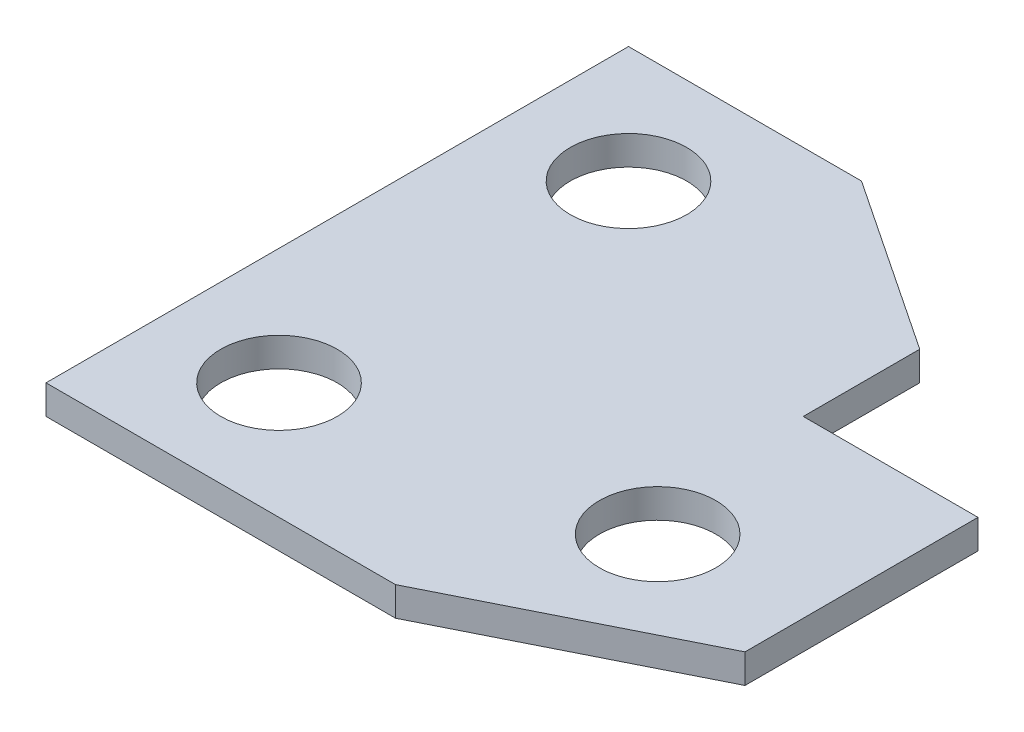
ISO-10303-21;
HEADER;
FILE_DESCRIPTION(('STEP AP214'),'2;1');
FILE_NAME('part.step','',(''),(''),'','','');
FILE_SCHEMA(('AUTOMOTIVE_DESIGN { 1 0 10303 214 1 1 1 1 }'));
ENDSEC;
DATA;
#1=APPLICATION_CONTEXT('core data for automotive mechanical design processes');
#2=APPLICATION_PROTOCOL_DEFINITION('international standard','automotive_design',2000,#1);
#3=PRODUCT_CONTEXT('',#1,'mechanical');
#4=PRODUCT('Part','Part','',(#3));
#5=PRODUCT_RELATED_PRODUCT_CATEGORY('part','',(#4));
#6=PRODUCT_DEFINITION_FORMATION('','',#4);
#7=PRODUCT_DEFINITION_CONTEXT('part definition',#1,'design');
#8=PRODUCT_DEFINITION('design','',#6,#7);
#9=PRODUCT_DEFINITION_SHAPE('','',#8);
#10=(LENGTH_UNIT() NAMED_UNIT(*) SI_UNIT(.MILLI.,.METRE.));
#11=(NAMED_UNIT(*) PLANE_ANGLE_UNIT() SI_UNIT($,.RADIAN.));
#12=(NAMED_UNIT(*) SI_UNIT($,.STERADIAN.) SOLID_ANGLE_UNIT());
#13=UNCERTAINTY_MEASURE_WITH_UNIT(LENGTH_MEASURE(1.E-05),#10,'distance_accuracy_value','');
#14=(GEOMETRIC_REPRESENTATION_CONTEXT(3) GLOBAL_UNCERTAINTY_ASSIGNED_CONTEXT((#13)) GLOBAL_UNIT_ASSIGNED_CONTEXT((#10,
#11,#12)) REPRESENTATION_CONTEXT('',''));
#15=CARTESIAN_POINT('',(0.,0.,0.));
#16=DIRECTION('',(0.,0.,1.));
#17=DIRECTION('',(1.,0.,0.));
#18=AXIS2_PLACEMENT_3D('',#15,#16,#17);
#19=CARTESIAN_POINT('',(0.,5.,0.));
#20=DIRECTION('',(0.,-1.,0.));
#21=DIRECTION('',(0.,0.,-1.));
#22=AXIS2_PLACEMENT_3D('',#19,#20,#21);
#23=PLANE('',#22);
#24=DIRECTION('',(0.,0.,1.));
#25=VECTOR('',#24,1.);
#26=CARTESIAN_POINT('',(0.,5.,0.));
#27=LINE('',#26,#25);
#28=CARTESIAN_POINT('',(0.,5.,-100.));
#29=VERTEX_POINT('',#28);
#30=CARTESIAN_POINT('',(0.,5.,0.));
#31=VERTEX_POINT('',#30);
#32=EDGE_CURVE('E168',#29,#31,#27,.T.);
#33=ORIENTED_EDGE('',*,*,#32,.T.);
#34=DIRECTION('',(1.,0.,0.));
#35=VECTOR('',#34,1.);
#36=CARTESIAN_POINT('',(0.,5.,0.));
#37=LINE('',#36,#35);
#38=CARTESIAN_POINT('',(60.,5.,0.));
#39=VERTEX_POINT('',#38);
#40=EDGE_CURVE('E104',#31,#39,#37,.T.);
#41=ORIENTED_EDGE('',*,*,#40,.T.);
#42=DIRECTION('',(0.894427190999916,0.,-0.447213595499958));
#43=VECTOR('',#42,1.);
#44=CARTESIAN_POINT('',(100.,5.,-20.));
#45=LINE('',#44,#43);
#46=CARTESIAN_POINT('',(100.,5.,-20.));
#47=VERTEX_POINT('',#46);
#48=EDGE_CURVE('E189',#39,#47,#45,.T.);
#49=ORIENTED_EDGE('',*,*,#48,.T.);
#50=DIRECTION('',(0.,0.,-1.));
#51=VECTOR('',#50,1.);
#52=CARTESIAN_POINT('',(100.,5.,-20.));
#53=LINE('',#52,#51);
#54=CARTESIAN_POINT('',(100.,5.,-60.));
#55=VERTEX_POINT('',#54);
#56=EDGE_CURVE('E203',#47,#55,#53,.T.);
#57=ORIENTED_EDGE('',*,*,#56,.T.);
#58=DIRECTION('',(-1.,0.,0.));
#59=VECTOR('',#58,1.);
#60=CARTESIAN_POINT('',(70.,5.,-60.));
#61=LINE('',#60,#59);
#62=CARTESIAN_POINT('',(70.,5.,-60.));
#63=VERTEX_POINT('',#62);
#64=EDGE_CURVE('E123',#55,#63,#61,.T.);
#65=ORIENTED_EDGE('',*,*,#64,.T.);
#66=DIRECTION('',(0.,0.,-1.));
#67=VECTOR('',#66,1.);
#68=CARTESIAN_POINT('',(70.,5.,-60.));
#69=LINE('',#68,#67);
#70=CARTESIAN_POINT('',(70.,5.,-80.));
#71=VERTEX_POINT('',#70);
#72=EDGE_CURVE('E117',#63,#71,#69,.T.);
#73=ORIENTED_EDGE('',*,*,#72,.T.);
#74=DIRECTION('',(-0.832050294337844,0.,-0.554700196225229));
#75=VECTOR('',#74,1.);
#76=CARTESIAN_POINT('',(40.,5.,-100.));
#77=LINE('',#76,#75);
#78=CARTESIAN_POINT('',(40.,5.,-100.));
#79=VERTEX_POINT('',#78);
#80=EDGE_CURVE('E121',#71,#79,#77,.T.);
#81=ORIENTED_EDGE('',*,*,#80,.T.);
#82=DIRECTION('',(-1.,0.,0.));
#83=VECTOR('',#82,1.);
#84=CARTESIAN_POINT('',(0.,5.,-100.));
#85=LINE('',#84,#83);
#86=EDGE_CURVE('E61',#79,#29,#85,.T.);
#87=ORIENTED_EDGE('',*,*,#86,.T.);
#88=EDGE_LOOP('',(#33,#41,#49,#57,#65,#73,#81,#87));
#89=FACE_BOUND('',#88,.T.);
#90=CARTESIAN_POINT('',(20.,5.,-80.));
#91=DIRECTION('',(0.,1.,0.));
#92=DIRECTION('',(0.,0.,1.));
#93=AXIS2_PLACEMENT_3D('',#90,#91,#92);
#94=CIRCLE('',#93,10.);
#95=CARTESIAN_POINT('',(20.,5.,-70.));
#96=VERTEX_POINT('',#95);
#97=EDGE_CURVE('E150',#96,#96,#94,.T.);
#98=ORIENTED_EDGE('',*,*,#97,.F.);
#99=EDGE_LOOP('',(#98));
#100=FACE_BOUND('',#99,.T.);
#101=CARTESIAN_POINT('',(20.,5.,-20.));
#102=DIRECTION('',(0.,1.,0.));
#103=DIRECTION('',(0.,0.,1.));
#104=AXIS2_PLACEMENT_3D('',#101,#102,#103);
#105=CIRCLE('',#104,10.);
#106=CARTESIAN_POINT('',(20.,5.,-10.));
#107=VERTEX_POINT('',#106);
#108=EDGE_CURVE('E217',#107,#107,#105,.T.);
#109=ORIENTED_EDGE('',*,*,#108,.F.);
#110=EDGE_LOOP('',(#109));
#111=FACE_BOUND('',#110,.T.);
#112=CARTESIAN_POINT('',(75.,5.,-30.));
#113=DIRECTION('',(0.,1.,0.));
#114=DIRECTION('',(0.,0.,1.));
#115=AXIS2_PLACEMENT_3D('',#112,#113,#114);
#116=CIRCLE('',#115,9.99999999999999);
#117=CARTESIAN_POINT('',(75.,5.,-20.));
#118=VERTEX_POINT('',#117);
#119=EDGE_CURVE('E225',#118,#118,#116,.T.);
#120=ORIENTED_EDGE('',*,*,#119,.F.);
#121=EDGE_LOOP('',(#120));
#122=FACE_BOUND('',#121,.T.);
#123=ADVANCED_FACE('F43',(#89,#100,#111,#122),#23,.F.);
#124=CARTESIAN_POINT('',(0.,0.,0.));
#125=DIRECTION('',(0.,-1.,0.));
#126=DIRECTION('',(0.,0.,-1.));
#127=AXIS2_PLACEMENT_3D('',#124,#125,#126);
#128=PLANE('',#127);
#129=CARTESIAN_POINT('',(20.,0.,-20.));
#130=DIRECTION('',(0.,1.,0.));
#131=DIRECTION('',(0.,0.,1.));
#132=AXIS2_PLACEMENT_3D('',#129,#130,#131);
#133=CIRCLE('',#132,10.);
#134=CARTESIAN_POINT('',(20.,0.,-10.));
#135=VERTEX_POINT('',#134);
#136=EDGE_CURVE('E221',#135,#135,#133,.T.);
#137=ORIENTED_EDGE('',*,*,#136,.T.);
#138=EDGE_LOOP('',(#137));
#139=FACE_BOUND('',#138,.T.);
#140=DIRECTION('',(0.,0.,1.));
#141=VECTOR('',#140,1.);
#142=CARTESIAN_POINT('',(0.,0.,0.));
#143=LINE('',#142,#141);
#144=CARTESIAN_POINT('',(0.,0.,-100.));
#145=VERTEX_POINT('',#144);
#146=CARTESIAN_POINT('',(0.,0.,0.));
#147=VERTEX_POINT('',#146);
#148=EDGE_CURVE('E145',#145,#147,#143,.T.);
#149=ORIENTED_EDGE('',*,*,#148,.F.);
#150=DIRECTION('',(-1.,0.,0.));
#151=VECTOR('',#150,1.);
#152=CARTESIAN_POINT('',(0.,0.,-100.));
#153=LINE('',#152,#151);
#154=CARTESIAN_POINT('',(40.,0.,-100.));
#155=VERTEX_POINT('',#154);
#156=EDGE_CURVE('E96',#155,#145,#153,.T.);
#157=ORIENTED_EDGE('',*,*,#156,.F.);
#158=DIRECTION('',(-0.832050294337844,0.,-0.554700196225229));
#159=VECTOR('',#158,1.);
#160=CARTESIAN_POINT('',(40.,0.,-100.));
#161=LINE('',#160,#159);
#162=CARTESIAN_POINT('',(70.,0.,-80.));
#163=VERTEX_POINT('',#162);
#164=EDGE_CURVE('E90',#163,#155,#161,.T.);
#165=ORIENTED_EDGE('',*,*,#164,.F.);
#166=DIRECTION('',(0.,0.,-1.));
#167=VECTOR('',#166,1.);
#168=CARTESIAN_POINT('',(70.,0.,-60.));
#169=LINE('',#168,#167);
#170=CARTESIAN_POINT('',(70.,0.,-60.));
#171=VERTEX_POINT('',#170);
#172=EDGE_CURVE('E132',#171,#163,#169,.T.);
#173=ORIENTED_EDGE('',*,*,#172,.F.);
#174=DIRECTION('',(-1.,0.,0.));
#175=VECTOR('',#174,1.);
#176=CARTESIAN_POINT('',(70.,0.,-60.));
#177=LINE('',#176,#175);
#178=CARTESIAN_POINT('',(100.,0.,-60.));
#179=VERTEX_POINT('',#178);
#180=EDGE_CURVE('E159',#179,#171,#177,.T.);
#181=ORIENTED_EDGE('',*,*,#180,.F.);
#182=DIRECTION('',(0.,0.,-1.));
#183=VECTOR('',#182,1.);
#184=CARTESIAN_POINT('',(100.,0.,-20.));
#185=LINE('',#184,#183);
#186=CARTESIAN_POINT('',(100.,0.,-20.));
#187=VERTEX_POINT('',#186);
#188=EDGE_CURVE('E156',#187,#179,#185,.T.);
#189=ORIENTED_EDGE('',*,*,#188,.F.);
#190=DIRECTION('',(0.894427190999916,0.,-0.447213595499958));
#191=VECTOR('',#190,1.);
#192=CARTESIAN_POINT('',(100.,0.,-20.));
#193=LINE('',#192,#191);
#194=CARTESIAN_POINT('',(60.,0.,0.));
#195=VERTEX_POINT('',#194);
#196=EDGE_CURVE('E153',#195,#187,#193,.T.);
#197=ORIENTED_EDGE('',*,*,#196,.F.);
#198=DIRECTION('',(1.,0.,0.));
#199=VECTOR('',#198,1.);
#200=CARTESIAN_POINT('',(0.,0.,0.));
#201=LINE('',#200,#199);
#202=EDGE_CURVE('E149',#147,#195,#201,.T.);
#203=ORIENTED_EDGE('',*,*,#202,.F.);
#204=EDGE_LOOP('',(#149,#157,#165,#173,#181,#189,#197,#203));
#205=FACE_BOUND('',#204,.T.);
#206=CARTESIAN_POINT('',(20.,0.,-80.));
#207=DIRECTION('',(0.,1.,0.));
#208=DIRECTION('',(0.,0.,1.));
#209=AXIS2_PLACEMENT_3D('',#206,#207,#208);
#210=CIRCLE('',#209,10.);
#211=CARTESIAN_POINT('',(20.,0.,-70.));
#212=VERTEX_POINT('',#211);
#213=EDGE_CURVE('E213',#212,#212,#210,.T.);
#214=ORIENTED_EDGE('',*,*,#213,.T.);
#215=EDGE_LOOP('',(#214));
#216=FACE_BOUND('',#215,.T.);
#217=CARTESIAN_POINT('',(75.,0.,-30.));
#218=DIRECTION('',(0.,1.,0.));
#219=DIRECTION('',(0.,0.,1.));
#220=AXIS2_PLACEMENT_3D('',#217,#218,#219);
#221=CIRCLE('',#220,9.99999999999999);
#222=CARTESIAN_POINT('',(75.,0.,-20.));
#223=VERTEX_POINT('',#222);
#224=EDGE_CURVE('E229',#223,#223,#221,.T.);
#225=ORIENTED_EDGE('',*,*,#224,.T.);
#226=EDGE_LOOP('',(#225));
#227=FACE_BOUND('',#226,.T.);
#228=ADVANCED_FACE('F193',(#139,#205,#216,#227),#128,.T.);
#229=CARTESIAN_POINT('',(0.,5.,0.));
#230=DIRECTION('',(1.,0.,0.));
#231=DIRECTION('',(0.,0.,-1.));
#232=AXIS2_PLACEMENT_3D('',#229,#230,#231);
#233=PLANE('',#232);
#234=ORIENTED_EDGE('',*,*,#148,.T.);
#235=DIRECTION('',(0.,-1.,0.));
#236=VECTOR('',#235,1.);
#237=CARTESIAN_POINT('',(0.,5.,0.));
#238=LINE('',#237,#236);
#239=EDGE_CURVE('E11',#31,#147,#238,.T.);
#240=ORIENTED_EDGE('',*,*,#239,.F.);
#241=ORIENTED_EDGE('',*,*,#32,.F.);
#242=DIRECTION('',(0.,-1.,0.));
#243=VECTOR('',#242,1.);
#244=CARTESIAN_POINT('',(0.,5.,-100.));
#245=LINE('',#244,#243);
#246=EDGE_CURVE('E141',#29,#145,#245,.T.);
#247=ORIENTED_EDGE('',*,*,#246,.T.);
#248=EDGE_LOOP('',(#234,#240,#241,#247));
#249=FACE_BOUND('',#248,.T.);
#250=ADVANCED_FACE('F45',(#249),#233,.F.);
#251=CARTESIAN_POINT('',(0.,5.,0.));
#252=DIRECTION('',(0.,0.,-1.));
#253=DIRECTION('',(-1.,0.,0.));
#254=AXIS2_PLACEMENT_3D('',#251,#252,#253);
#255=PLANE('',#254);
#256=ORIENTED_EDGE('',*,*,#202,.T.);
#257=DIRECTION('',(0.,-1.,0.));
#258=VECTOR('',#257,1.);
#259=CARTESIAN_POINT('',(60.,5.,0.));
#260=LINE('',#259,#258);
#261=EDGE_CURVE('E53',#39,#195,#260,.T.);
#262=ORIENTED_EDGE('',*,*,#261,.F.);
#263=ORIENTED_EDGE('',*,*,#40,.F.);
#264=ORIENTED_EDGE('',*,*,#239,.T.);
#265=EDGE_LOOP('',(#256,#262,#263,#264));
#266=FACE_BOUND('',#265,.T.);
#267=ADVANCED_FACE('F263',(#266),#255,.F.);
#268=CARTESIAN_POINT('',(100.,5.,-20.));
#269=DIRECTION('',(-0.447213595499958,0.,-0.894427190999916));
#270=DIRECTION('',(-0.894427190999916,0.,0.447213595499958));
#271=AXIS2_PLACEMENT_3D('',#268,#269,#270);
#272=PLANE('',#271);
#273=ORIENTED_EDGE('',*,*,#196,.T.);
#274=DIRECTION('',(0.,-1.,0.));
#275=VECTOR('',#274,1.);
#276=CARTESIAN_POINT('',(100.,5.,-20.));
#277=LINE('',#276,#275);
#278=EDGE_CURVE('E179',#47,#187,#277,.T.);
#279=ORIENTED_EDGE('',*,*,#278,.F.);
#280=ORIENTED_EDGE('',*,*,#48,.F.);
#281=ORIENTED_EDGE('',*,*,#261,.T.);
#282=EDGE_LOOP('',(#273,#279,#280,#281));
#283=FACE_BOUND('',#282,.T.);
#284=ADVANCED_FACE('F187',(#283),#272,.F.);
#285=CARTESIAN_POINT('',(100.,5.,-20.));
#286=DIRECTION('',(-1.,0.,0.));
#287=DIRECTION('',(0.,0.,1.));
#288=AXIS2_PLACEMENT_3D('',#285,#286,#287);
#289=PLANE('',#288);
#290=ORIENTED_EDGE('',*,*,#188,.T.);
#291=DIRECTION('',(0.,-1.,0.));
#292=VECTOR('',#291,1.);
#293=CARTESIAN_POINT('',(100.,5.,-60.));
#294=LINE('',#293,#292);
#295=EDGE_CURVE('E175',#55,#179,#294,.T.);
#296=ORIENTED_EDGE('',*,*,#295,.F.);
#297=ORIENTED_EDGE('',*,*,#56,.F.);
#298=ORIENTED_EDGE('',*,*,#278,.T.);
#299=EDGE_LOOP('',(#290,#296,#297,#298));
#300=FACE_BOUND('',#299,.T.);
#301=ADVANCED_FACE('F198',(#300),#289,.F.);
#302=CARTESIAN_POINT('',(70.,5.,-60.));
#303=DIRECTION('',(0.,0.,1.));
#304=DIRECTION('',(1.,0.,0.));
#305=AXIS2_PLACEMENT_3D('',#302,#303,#304);
#306=PLANE('',#305);
#307=ORIENTED_EDGE('',*,*,#180,.T.);
#308=DIRECTION('',(0.,-1.,0.));
#309=VECTOR('',#308,1.);
#310=CARTESIAN_POINT('',(70.,5.,-60.));
#311=LINE('',#310,#309);
#312=EDGE_CURVE('E134',#63,#171,#311,.T.);
#313=ORIENTED_EDGE('',*,*,#312,.F.);
#314=ORIENTED_EDGE('',*,*,#64,.F.);
#315=ORIENTED_EDGE('',*,*,#295,.T.);
#316=EDGE_LOOP('',(#307,#313,#314,#315));
#317=FACE_BOUND('',#316,.T.);
#318=ADVANCED_FACE('F201',(#317),#306,.F.);
#319=CARTESIAN_POINT('',(70.,5.,-60.));
#320=DIRECTION('',(-1.,0.,0.));
#321=DIRECTION('',(0.,0.,1.));
#322=AXIS2_PLACEMENT_3D('',#319,#320,#321);
#323=PLANE('',#322);
#324=ORIENTED_EDGE('',*,*,#172,.T.);
#325=DIRECTION('',(0.,-1.,0.));
#326=VECTOR('',#325,1.);
#327=CARTESIAN_POINT('',(70.,5.,-80.));
#328=LINE('',#327,#326);
#329=EDGE_CURVE('E129',#71,#163,#328,.T.);
#330=ORIENTED_EDGE('',*,*,#329,.F.);
#331=ORIENTED_EDGE('',*,*,#72,.F.);
#332=ORIENTED_EDGE('',*,*,#312,.T.);
#333=EDGE_LOOP('',(#324,#330,#331,#332));
#334=FACE_BOUND('',#333,.T.);
#335=ADVANCED_FACE('F130',(#334),#323,.F.);
#336=CARTESIAN_POINT('',(40.,5.,-100.));
#337=DIRECTION('',(-0.554700196225229,0.,0.832050294337844));
#338=DIRECTION('',(0.832050294337844,0.,0.554700196225229));
#339=AXIS2_PLACEMENT_3D('',#336,#337,#338);
#340=PLANE('',#339);
#341=ORIENTED_EDGE('',*,*,#164,.T.);
#342=DIRECTION('',(0.,-1.,0.));
#343=VECTOR('',#342,1.);
#344=CARTESIAN_POINT('',(40.,5.,-100.));
#345=LINE('',#344,#343);
#346=EDGE_CURVE('E135',#79,#155,#345,.T.);
#347=ORIENTED_EDGE('',*,*,#346,.F.);
#348=ORIENTED_EDGE('',*,*,#80,.F.);
#349=ORIENTED_EDGE('',*,*,#329,.T.);
#350=EDGE_LOOP('',(#341,#347,#348,#349));
#351=FACE_BOUND('',#350,.T.);
#352=ADVANCED_FACE('F137',(#351),#340,.F.);
#353=CARTESIAN_POINT('',(0.,5.,-100.));
#354=DIRECTION('',(0.,0.,1.));
#355=DIRECTION('',(1.,0.,0.));
#356=AXIS2_PLACEMENT_3D('',#353,#354,#355);
#357=PLANE('',#356);
#358=ORIENTED_EDGE('',*,*,#156,.T.);
#359=ORIENTED_EDGE('',*,*,#246,.F.);
#360=ORIENTED_EDGE('',*,*,#86,.F.);
#361=ORIENTED_EDGE('',*,*,#346,.T.);
#362=EDGE_LOOP('',(#358,#359,#360,#361));
#363=FACE_BOUND('',#362,.T.);
#364=ADVANCED_FACE('F251',(#363),#357,.F.);
#365=CARTESIAN_POINT('',(20.,5.,-80.));
#366=DIRECTION('',(0.,-1.,0.));
#367=DIRECTION('',(0.,0.,-1.));
#368=AXIS2_PLACEMENT_3D('',#365,#366,#367);
#369=CYLINDRICAL_SURFACE('',#368,10.);
#370=ORIENTED_EDGE('',*,*,#97,.T.);
#371=EDGE_LOOP('',(#370));
#372=FACE_BOUND('',#371,.T.);
#373=ORIENTED_EDGE('',*,*,#213,.F.);
#374=EDGE_LOOP('',(#373));
#375=FACE_BOUND('',#374,.T.);
#376=ADVANCED_FACE('F248',(#372,#375),#369,.F.);
#377=CARTESIAN_POINT('',(20.,5.,-20.));
#378=DIRECTION('',(0.,-1.,0.));
#379=DIRECTION('',(0.,0.,-1.));
#380=AXIS2_PLACEMENT_3D('',#377,#378,#379);
#381=CYLINDRICAL_SURFACE('',#380,10.);
#382=ORIENTED_EDGE('',*,*,#108,.T.);
#383=EDGE_LOOP('',(#382));
#384=FACE_BOUND('',#383,.T.);
#385=ORIENTED_EDGE('',*,*,#136,.F.);
#386=EDGE_LOOP('',(#385));
#387=FACE_BOUND('',#386,.T.);
#388=ADVANCED_FACE('F339',(#384,#387),#381,.F.);
#389=CARTESIAN_POINT('',(75.,5.,-30.));
#390=DIRECTION('',(0.,-1.,0.));
#391=DIRECTION('',(0.,0.,-1.));
#392=AXIS2_PLACEMENT_3D('',#389,#390,#391);
#393=CYLINDRICAL_SURFACE('',#392,9.99999999999999);
#394=ORIENTED_EDGE('',*,*,#119,.T.);
#395=EDGE_LOOP('',(#394));
#396=FACE_BOUND('',#395,.T.);
#397=ORIENTED_EDGE('',*,*,#224,.F.);
#398=EDGE_LOOP('',(#397));
#399=FACE_BOUND('',#398,.T.);
#400=ADVANCED_FACE('F237',(#396,#399),#393,.F.);
#401=CLOSED_SHELL('',(#123,#228,#250,#267,#284,#301,#318,#335,#352,#364,#376,#388,#400));
#402=MANIFOLD_SOLID_BREP('B2',#401);
#403=ADVANCED_BREP_SHAPE_REPRESENTATION('',(#18,#402),#14);
#404=SHAPE_DEFINITION_REPRESENTATION(#9,#403);
ENDSEC;
END-ISO-10303-21;
